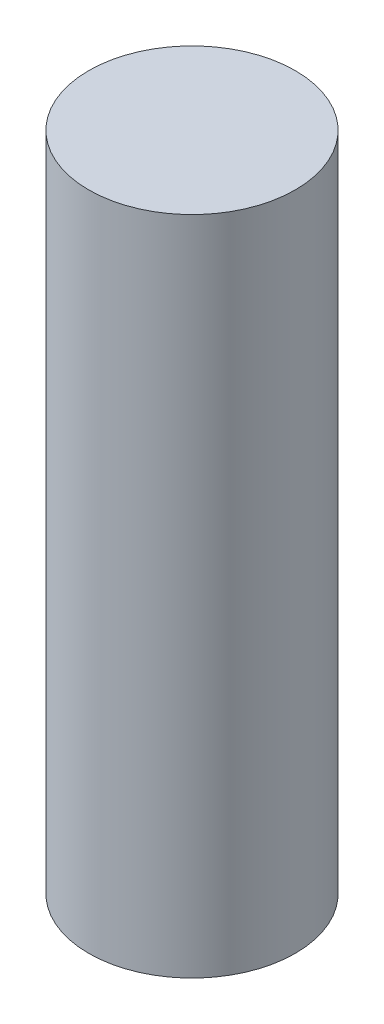
ISO-10303-21;
HEADER;
FILE_DESCRIPTION(('STEP AP214'),'2;1');
FILE_NAME('part.step','',(''),(''),'','','');
FILE_SCHEMA(('AUTOMOTIVE_DESIGN { 1 0 10303 214 1 1 1 1 }'));
ENDSEC;
DATA;
#1=APPLICATION_CONTEXT('core data for automotive mechanical design processes');
#2=APPLICATION_PROTOCOL_DEFINITION('international standard','automotive_design',2000,#1);
#3=PRODUCT_CONTEXT('',#1,'mechanical');
#4=PRODUCT('Part','Part','',(#3));
#5=PRODUCT_RELATED_PRODUCT_CATEGORY('part','',(#4));
#6=PRODUCT_DEFINITION_FORMATION('','',#4);
#7=PRODUCT_DEFINITION_CONTEXT('part definition',#1,'design');
#8=PRODUCT_DEFINITION('design','',#6,#7);
#9=PRODUCT_DEFINITION_SHAPE('','',#8);
#10=(LENGTH_UNIT() NAMED_UNIT(*) SI_UNIT(.MILLI.,.METRE.));
#11=(NAMED_UNIT(*) PLANE_ANGLE_UNIT() SI_UNIT($,.RADIAN.));
#12=(NAMED_UNIT(*) SI_UNIT($,.STERADIAN.) SOLID_ANGLE_UNIT());
#13=UNCERTAINTY_MEASURE_WITH_UNIT(LENGTH_MEASURE(1.E-05),#10,'distance_accuracy_value','');
#14=(GEOMETRIC_REPRESENTATION_CONTEXT(3) GLOBAL_UNCERTAINTY_ASSIGNED_CONTEXT((#13)) GLOBAL_UNIT_ASSIGNED_CONTEXT((#10,
#11,#12)) REPRESENTATION_CONTEXT('',''));
#15=CARTESIAN_POINT('',(0.,0.,0.));
#16=DIRECTION('',(0.,0.,1.));
#17=DIRECTION('',(1.,0.,0.));
#18=AXIS2_PLACEMENT_3D('',#15,#16,#17);
#19=CARTESIAN_POINT('',(0.,60.96,0.));
#20=DIRECTION('',(0.,-1.,0.));
#21=DIRECTION('',(0.,0.,-1.));
#22=AXIS2_PLACEMENT_3D('',#19,#20,#21);
#23=CYLINDRICAL_SURFACE('',#22,9.525);
#24=CARTESIAN_POINT('',(0.,60.96,0.));
#25=DIRECTION('',(0.,1.,0.));
#26=DIRECTION('',(0.,0.,1.));
#27=AXIS2_PLACEMENT_3D('',#24,#25,#26);
#28=CIRCLE('',#27,9.525);
#29=CARTESIAN_POINT('',(0.,60.96,9.525));
#30=VERTEX_POINT('',#29);
#31=EDGE_CURVE('E10',#30,#30,#28,.T.);
#32=ORIENTED_EDGE('',*,*,#31,.F.);
#33=EDGE_LOOP('',(#32));
#34=FACE_BOUND('',#33,.T.);
#35=CARTESIAN_POINT('',(0.,0.,0.));
#36=DIRECTION('',(0.,1.,0.));
#37=DIRECTION('',(0.,0.,1.));
#38=AXIS2_PLACEMENT_3D('',#35,#36,#37);
#39=CIRCLE('',#38,9.525);
#40=CARTESIAN_POINT('',(0.,0.,9.525));
#41=VERTEX_POINT('',#40);
#42=EDGE_CURVE('E36',#41,#41,#39,.T.);
#43=ORIENTED_EDGE('',*,*,#42,.T.);
#44=EDGE_LOOP('',(#43));
#45=FACE_BOUND('',#44,.T.);
#46=ADVANCED_FACE('F33',(#34,#45),#23,.T.);
#47=CARTESIAN_POINT('',(0.,60.96,0.));
#48=DIRECTION('',(0.,1.,0.));
#49=DIRECTION('',(0.,0.,1.));
#50=AXIS2_PLACEMENT_3D('',#47,#48,#49);
#51=PLANE('',#50);
#52=ORIENTED_EDGE('',*,*,#31,.T.);
#53=EDGE_LOOP('',(#52));
#54=FACE_BOUND('',#53,.T.);
#55=ADVANCED_FACE('F48',(#54),#51,.T.);
#56=CARTESIAN_POINT('',(0.,0.,0.));
#57=DIRECTION('',(0.,1.,0.));
#58=DIRECTION('',(0.,0.,1.));
#59=AXIS2_PLACEMENT_3D('',#56,#57,#58);
#60=PLANE('',#59);
#61=ORIENTED_EDGE('',*,*,#42,.F.);
#62=EDGE_LOOP('',(#61));
#63=FACE_BOUND('',#62,.T.);
#64=ADVANCED_FACE('F46',(#63),#60,.F.);
#65=CLOSED_SHELL('',(#46,#55,#64));
#66=MANIFOLD_SOLID_BREP('B2',#65);
#67=ADVANCED_BREP_SHAPE_REPRESENTATION('',(#18,#66),#14);
#68=SHAPE_DEFINITION_REPRESENTATION(#9,#67);
ENDSEC;
END-ISO-10303-21;
